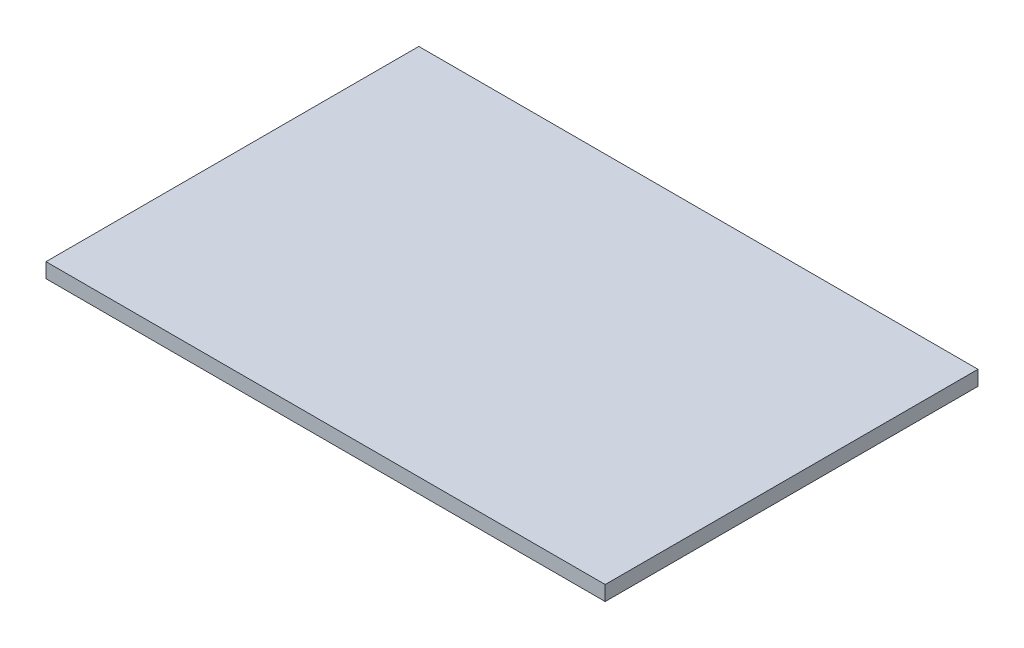
ISO-10303-21;
HEADER;
FILE_DESCRIPTION(('STEP AP214'),'2;1');
FILE_NAME('part.step','',(''),(''),'','','');
FILE_SCHEMA(('AUTOMOTIVE_DESIGN { 1 0 10303 214 1 1 1 1 }'));
ENDSEC;
DATA;
#1=APPLICATION_CONTEXT('core data for automotive mechanical design processes');
#2=APPLICATION_PROTOCOL_DEFINITION('international standard','automotive_design',2000,#1);
#3=PRODUCT_CONTEXT('',#1,'mechanical');
#4=PRODUCT('Part','Part','',(#3));
#5=PRODUCT_RELATED_PRODUCT_CATEGORY('part','',(#4));
#6=PRODUCT_DEFINITION_FORMATION('','',#4);
#7=PRODUCT_DEFINITION_CONTEXT('part definition',#1,'design');
#8=PRODUCT_DEFINITION('design','',#6,#7);
#9=PRODUCT_DEFINITION_SHAPE('','',#8);
#10=(LENGTH_UNIT() NAMED_UNIT(*) SI_UNIT(.MILLI.,.METRE.));
#11=(NAMED_UNIT(*) PLANE_ANGLE_UNIT() SI_UNIT($,.RADIAN.));
#12=(NAMED_UNIT(*) SI_UNIT($,.STERADIAN.) SOLID_ANGLE_UNIT());
#13=UNCERTAINTY_MEASURE_WITH_UNIT(LENGTH_MEASURE(1.E-05),#10,'distance_accuracy_value','');
#14=(GEOMETRIC_REPRESENTATION_CONTEXT(3) GLOBAL_UNCERTAINTY_ASSIGNED_CONTEXT((#13)) GLOBAL_UNIT_ASSIGNED_CONTEXT((#10,
#11,#12)) REPRESENTATION_CONTEXT('',''));
#15=CARTESIAN_POINT('',(0.,0.,0.));
#16=DIRECTION('',(0.,0.,1.));
#17=DIRECTION('',(1.,0.,0.));
#18=AXIS2_PLACEMENT_3D('',#15,#16,#17);
#19=CARTESIAN_POINT('',(30.,1.5875,20.));
#20=DIRECTION('',(-1.,0.,0.));
#21=DIRECTION('',(0.,0.,1.));
#22=AXIS2_PLACEMENT_3D('',#19,#20,#21);
#23=PLANE('',#22);
#24=DIRECTION('',(0.,0.,-1.));
#25=VECTOR('',#24,1.);
#26=CARTESIAN_POINT('',(30.,0.,20.));
#27=LINE('',#26,#25);
#28=CARTESIAN_POINT('',(30.,0.,20.));
#29=VERTEX_POINT('',#28);
#30=CARTESIAN_POINT('',(30.,0.,-20.));
#31=VERTEX_POINT('',#30);
#32=EDGE_CURVE('E96',#29,#31,#27,.T.);
#33=ORIENTED_EDGE('',*,*,#32,.T.);
#34=DIRECTION('',(0.,-1.,0.));
#35=VECTOR('',#34,1.);
#36=CARTESIAN_POINT('',(30.,1.5875,-20.));
#37=LINE('',#36,#35);
#38=CARTESIAN_POINT('',(30.,1.5875,-20.));
#39=VERTEX_POINT('',#38);
#40=EDGE_CURVE('E11',#39,#31,#37,.T.);
#41=ORIENTED_EDGE('',*,*,#40,.F.);
#42=DIRECTION('',(0.,0.,-1.));
#43=VECTOR('',#42,1.);
#44=CARTESIAN_POINT('',(30.,1.5875,20.));
#45=LINE('',#44,#43);
#46=CARTESIAN_POINT('',(30.,1.5875,20.));
#47=VERTEX_POINT('',#46);
#48=EDGE_CURVE('E84',#47,#39,#45,.T.);
#49=ORIENTED_EDGE('',*,*,#48,.F.);
#50=DIRECTION('',(0.,-1.,0.));
#51=VECTOR('',#50,1.);
#52=CARTESIAN_POINT('',(30.,1.5875,20.));
#53=LINE('',#52,#51);
#54=EDGE_CURVE('E92',#47,#29,#53,.T.);
#55=ORIENTED_EDGE('',*,*,#54,.T.);
#56=EDGE_LOOP('',(#33,#41,#49,#55));
#57=FACE_BOUND('',#56,.T.);
#58=ADVANCED_FACE('F33',(#57),#23,.F.);
#59=CARTESIAN_POINT('',(-30.,1.5875,-20.));
#60=DIRECTION('',(0.,0.,1.));
#61=DIRECTION('',(1.,0.,0.));
#62=AXIS2_PLACEMENT_3D('',#59,#60,#61);
#63=PLANE('',#62);
#64=DIRECTION('',(-1.,0.,0.));
#65=VECTOR('',#64,1.);
#66=CARTESIAN_POINT('',(-30.,0.,-20.));
#67=LINE('',#66,#65);
#68=CARTESIAN_POINT('',(-30.,0.,-20.));
#69=VERTEX_POINT('',#68);
#70=EDGE_CURVE('E88',#31,#69,#67,.T.);
#71=ORIENTED_EDGE('',*,*,#70,.T.);
#72=DIRECTION('',(0.,-1.,0.));
#73=VECTOR('',#72,1.);
#74=CARTESIAN_POINT('',(-30.,1.5875,-20.));
#75=LINE('',#74,#73);
#76=CARTESIAN_POINT('',(-30.,1.5875,-20.));
#77=VERTEX_POINT('',#76);
#78=EDGE_CURVE('E41',#77,#69,#75,.T.);
#79=ORIENTED_EDGE('',*,*,#78,.F.);
#80=DIRECTION('',(-1.,0.,0.));
#81=VECTOR('',#80,1.);
#82=CARTESIAN_POINT('',(-30.,1.5875,-20.));
#83=LINE('',#82,#81);
#84=EDGE_CURVE('E79',#39,#77,#83,.T.);
#85=ORIENTED_EDGE('',*,*,#84,.F.);
#86=ORIENTED_EDGE('',*,*,#40,.T.);
#87=EDGE_LOOP('',(#71,#79,#85,#86));
#88=FACE_BOUND('',#87,.T.);
#89=ADVANCED_FACE('F87',(#88),#63,.F.);
#90=CARTESIAN_POINT('',(-30.,1.5875,20.));
#91=DIRECTION('',(1.,0.,0.));
#92=DIRECTION('',(0.,0.,-1.));
#93=AXIS2_PLACEMENT_3D('',#90,#91,#92);
#94=PLANE('',#93);
#95=DIRECTION('',(0.,0.,1.));
#96=VECTOR('',#95,1.);
#97=CARTESIAN_POINT('',(-30.,0.,20.));
#98=LINE('',#97,#96);
#99=CARTESIAN_POINT('',(-30.,0.,20.));
#100=VERTEX_POINT('',#99);
#101=EDGE_CURVE('E66',#69,#100,#98,.T.);
#102=ORIENTED_EDGE('',*,*,#101,.T.);
#103=DIRECTION('',(0.,-1.,0.));
#104=VECTOR('',#103,1.);
#105=CARTESIAN_POINT('',(-30.,1.5875,20.));
#106=LINE('',#105,#104);
#107=CARTESIAN_POINT('',(-30.,1.5875,20.));
#108=VERTEX_POINT('',#107);
#109=EDGE_CURVE('E89',#108,#100,#106,.T.);
#110=ORIENTED_EDGE('',*,*,#109,.F.);
#111=DIRECTION('',(0.,0.,1.));
#112=VECTOR('',#111,1.);
#113=CARTESIAN_POINT('',(-30.,1.5875,20.));
#114=LINE('',#113,#112);
#115=EDGE_CURVE('E82',#77,#108,#114,.T.);
#116=ORIENTED_EDGE('',*,*,#115,.F.);
#117=ORIENTED_EDGE('',*,*,#78,.T.);
#118=EDGE_LOOP('',(#102,#110,#116,#117));
#119=FACE_BOUND('',#118,.T.);
#120=ADVANCED_FACE('F90',(#119),#94,.F.);
#121=CARTESIAN_POINT('',(-30.,1.5875,20.));
#122=DIRECTION('',(0.,0.,-1.));
#123=DIRECTION('',(-1.,0.,0.));
#124=AXIS2_PLACEMENT_3D('',#121,#122,#123);
#125=PLANE('',#124);
#126=DIRECTION('',(1.,0.,0.));
#127=VECTOR('',#126,1.);
#128=CARTESIAN_POINT('',(-30.,0.,20.));
#129=LINE('',#128,#127);
#130=EDGE_CURVE('E72',#100,#29,#129,.T.);
#131=ORIENTED_EDGE('',*,*,#130,.T.);
#132=ORIENTED_EDGE('',*,*,#54,.F.);
#133=DIRECTION('',(1.,0.,0.));
#134=VECTOR('',#133,1.);
#135=CARTESIAN_POINT('',(-30.,1.5875,20.));
#136=LINE('',#135,#134);
#137=EDGE_CURVE('E49',#108,#47,#136,.T.);
#138=ORIENTED_EDGE('',*,*,#137,.F.);
#139=ORIENTED_EDGE('',*,*,#109,.T.);
#140=EDGE_LOOP('',(#131,#132,#138,#139));
#141=FACE_BOUND('',#140,.T.);
#142=ADVANCED_FACE('F103',(#141),#125,.F.);
#143=CARTESIAN_POINT('',(0.,1.5875,0.));
#144=DIRECTION('',(0.,-1.,0.));
#145=DIRECTION('',(0.,0.,-1.));
#146=AXIS2_PLACEMENT_3D('',#143,#144,#145);
#147=PLANE('',#146);
#148=ORIENTED_EDGE('',*,*,#48,.T.);
#149=ORIENTED_EDGE('',*,*,#84,.T.);
#150=ORIENTED_EDGE('',*,*,#115,.T.);
#151=ORIENTED_EDGE('',*,*,#137,.T.);
#152=EDGE_LOOP('',(#148,#149,#150,#151));
#153=FACE_BOUND('',#152,.T.);
#154=ADVANCED_FACE('F80',(#153),#147,.F.);
#155=CARTESIAN_POINT('',(0.,0.,0.));
#156=DIRECTION('',(0.,-1.,0.));
#157=DIRECTION('',(0.,0.,-1.));
#158=AXIS2_PLACEMENT_3D('',#155,#156,#157);
#159=PLANE('',#158);
#160=ORIENTED_EDGE('',*,*,#32,.F.);
#161=ORIENTED_EDGE('',*,*,#130,.F.);
#162=ORIENTED_EDGE('',*,*,#101,.F.);
#163=ORIENTED_EDGE('',*,*,#70,.F.);
#164=EDGE_LOOP('',(#160,#161,#162,#163));
#165=FACE_BOUND('',#164,.T.);
#166=ADVANCED_FACE('F106',(#165),#159,.T.);
#167=CLOSED_SHELL('',(#58,#89,#120,#142,#154,#166));
#168=MANIFOLD_SOLID_BREP('B2',#167);
#169=ADVANCED_BREP_SHAPE_REPRESENTATION('',(#18,#168),#14);
#170=SHAPE_DEFINITION_REPRESENTATION(#9,#169);
ENDSEC;
END-ISO-10303-21;
